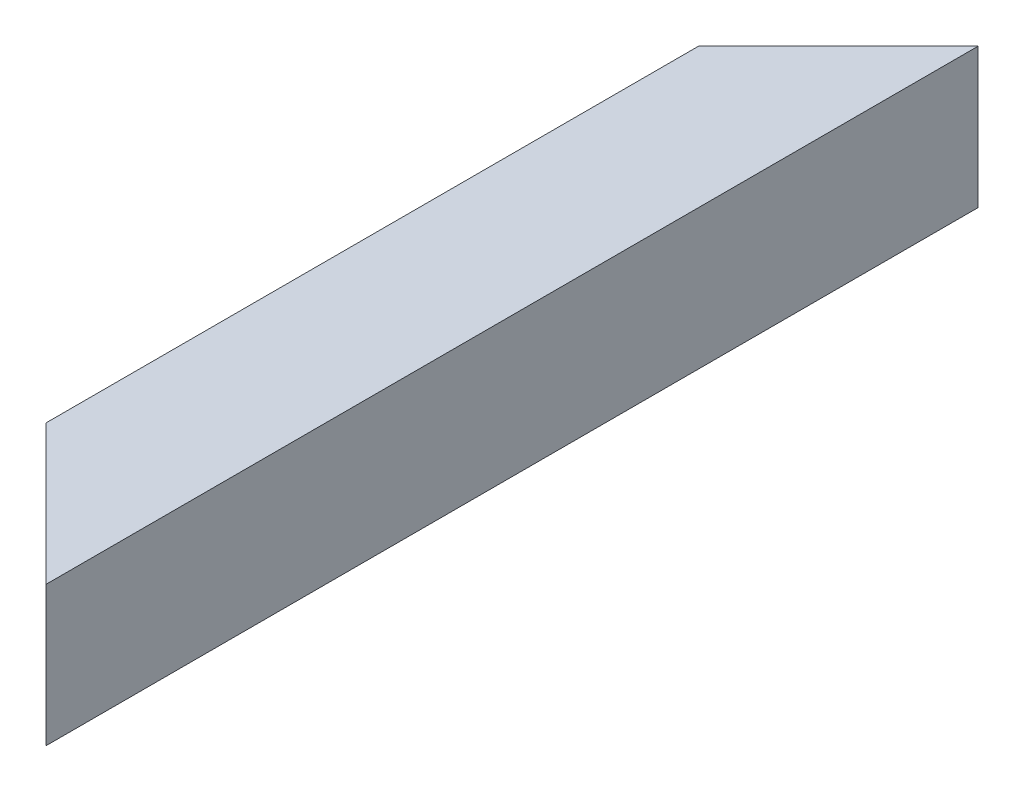
ISO-10303-21;
HEADER;
FILE_DESCRIPTION(('STEP AP214'),'2;1');
FILE_NAME('part.step','',(''),(''),'','','');
FILE_SCHEMA(('AUTOMOTIVE_DESIGN { 1 0 10303 214 1 1 1 1 }'));
ENDSEC;
DATA;
#1=APPLICATION_CONTEXT('core data for automotive mechanical design processes');
#2=APPLICATION_PROTOCOL_DEFINITION('international standard','automotive_design',2000,#1);
#3=PRODUCT_CONTEXT('',#1,'mechanical');
#4=PRODUCT('Part','Part','',(#3));
#5=PRODUCT_RELATED_PRODUCT_CATEGORY('part','',(#4));
#6=PRODUCT_DEFINITION_FORMATION('','',#4);
#7=PRODUCT_DEFINITION_CONTEXT('part definition',#1,'design');
#8=PRODUCT_DEFINITION('design','',#6,#7);
#9=PRODUCT_DEFINITION_SHAPE('','',#8);
#10=(LENGTH_UNIT() NAMED_UNIT(*) SI_UNIT(.MILLI.,.METRE.));
#11=(NAMED_UNIT(*) PLANE_ANGLE_UNIT() SI_UNIT($,.RADIAN.));
#12=(NAMED_UNIT(*) SI_UNIT($,.STERADIAN.) SOLID_ANGLE_UNIT());
#13=UNCERTAINTY_MEASURE_WITH_UNIT(LENGTH_MEASURE(1.E-05),#10,'distance_accuracy_value','');
#14=(GEOMETRIC_REPRESENTATION_CONTEXT(3) GLOBAL_UNCERTAINTY_ASSIGNED_CONTEXT((#13)) GLOBAL_UNIT_ASSIGNED_CONTEXT((#10,
#11,#12)) REPRESENTATION_CONTEXT('',''));
#15=CARTESIAN_POINT('',(0.,0.,0.));
#16=DIRECTION('',(0.,0.,1.));
#17=DIRECTION('',(1.,0.,0.));
#18=AXIS2_PLACEMENT_3D('',#15,#16,#17);
#19=CARTESIAN_POINT('',(-26.,26.,0.));
#20=DIRECTION('',(1.,0.,0.));
#21=DIRECTION('',(0.,0.,-1.));
#22=AXIS2_PLACEMENT_3D('',#19,#20,#21);
#23=PLANE('',#22);
#24=DIRECTION('',(0.,-1.,0.));
#25=VECTOR('',#24,1.);
#26=CARTESIAN_POINT('',(-26.,26.,55.9999999999994));
#27=LINE('',#26,#25);
#28=CARTESIAN_POINT('',(-26.,26.,55.9999999999994));
#29=VERTEX_POINT('',#28);
#30=CARTESIAN_POINT('',(-26.,-26.,55.9999999999994));
#31=VERTEX_POINT('',#30);
#32=EDGE_CURVE('E11',#29,#31,#27,.T.);
#33=ORIENTED_EDGE('',*,*,#32,.F.);
#34=DIRECTION('',(0.,0.,1.));
#35=VECTOR('',#34,1.);
#36=CARTESIAN_POINT('',(-26.,26.,0.));
#37=LINE('',#36,#35);
#38=CARTESIAN_POINT('',(-26.,26.,344.000000000001));
#39=VERTEX_POINT('',#38);
#40=EDGE_CURVE('E147',#29,#39,#37,.T.);
#41=ORIENTED_EDGE('',*,*,#40,.T.);
#42=DIRECTION('',(0.,1.,0.));
#43=VECTOR('',#42,1.);
#44=CARTESIAN_POINT('',(-26.,26.,344.000000000001));
#45=LINE('',#44,#43);
#46=CARTESIAN_POINT('',(-26.,-26.,344.000000000001));
#47=VERTEX_POINT('',#46);
#48=EDGE_CURVE('E45',#47,#39,#45,.T.);
#49=ORIENTED_EDGE('',*,*,#48,.F.);
#50=DIRECTION('',(0.,0.,1.));
#51=VECTOR('',#50,1.);
#52=CARTESIAN_POINT('',(-26.,-26.,0.));
#53=LINE('',#52,#51);
#54=EDGE_CURVE('E134',#31,#47,#53,.T.);
#55=ORIENTED_EDGE('',*,*,#54,.F.);
#56=EDGE_LOOP('',(#33,#41,#49,#55));
#57=FACE_BOUND('',#56,.T.);
#58=ADVANCED_FACE('F37',(#57),#23,.T.);
#59=CARTESIAN_POINT('',(-26.,-26.,0.));
#60=DIRECTION('',(0.,1.,0.));
#61=DIRECTION('',(0.,0.,1.));
#62=AXIS2_PLACEMENT_3D('',#59,#60,#61);
#63=PLANE('',#62);
#64=DIRECTION('',(0.707106781186551,0.,-0.707106781186544));
#65=VECTOR('',#64,1.);
#66=CARTESIAN_POINT('',(1.9999999999997,-26.,28.));
#67=LINE('',#66,#65);
#68=CARTESIAN_POINT('',(26.,-26.,3.99999999999995));
#69=VERTEX_POINT('',#68);
#70=EDGE_CURVE('E167',#31,#69,#67,.T.);
#71=ORIENTED_EDGE('',*,*,#70,.F.);
#72=ORIENTED_EDGE('',*,*,#54,.T.);
#73=DIRECTION('',(-0.707106781186551,0.,-0.707106781186544));
#74=VECTOR('',#73,1.);
#75=CARTESIAN_POINT('',(-198.,-26.,172.000000000002));
#76=LINE('',#75,#74);
#77=CARTESIAN_POINT('',(26.,-26.,396.));
#78=VERTEX_POINT('',#77);
#79=EDGE_CURVE('E59',#78,#47,#76,.T.);
#80=ORIENTED_EDGE('',*,*,#79,.F.);
#81=DIRECTION('',(0.,0.,1.));
#82=VECTOR('',#81,1.);
#83=CARTESIAN_POINT('',(26.,-26.,0.));
#84=LINE('',#83,#82);
#85=EDGE_CURVE('E137',#69,#78,#84,.T.);
#86=ORIENTED_EDGE('',*,*,#85,.F.);
#87=EDGE_LOOP('',(#71,#72,#80,#86));
#88=FACE_BOUND('',#87,.T.);
#89=ADVANCED_FACE('F183',(#88),#63,.T.);
#90=CARTESIAN_POINT('',(26.,26.,0.));
#91=DIRECTION('',(-1.,0.,0.));
#92=DIRECTION('',(0.,0.,1.));
#93=AXIS2_PLACEMENT_3D('',#90,#91,#92);
#94=PLANE('',#93);
#95=DIRECTION('',(0.,1.,0.));
#96=VECTOR('',#95,1.);
#97=CARTESIAN_POINT('',(26.,26.,3.99999999999995));
#98=LINE('',#97,#96);
#99=CARTESIAN_POINT('',(26.,26.,3.99999999999995));
#100=VERTEX_POINT('',#99);
#101=EDGE_CURVE('E169',#69,#100,#98,.T.);
#102=ORIENTED_EDGE('',*,*,#101,.F.);
#103=ORIENTED_EDGE('',*,*,#85,.T.);
#104=DIRECTION('',(0.,-1.,0.));
#105=VECTOR('',#104,1.);
#106=CARTESIAN_POINT('',(26.,26.,396.));
#107=LINE('',#106,#105);
#108=CARTESIAN_POINT('',(26.,26.,396.));
#109=VERTEX_POINT('',#108);
#110=EDGE_CURVE('E163',#109,#78,#107,.T.);
#111=ORIENTED_EDGE('',*,*,#110,.F.);
#112=DIRECTION('',(0.,0.,1.));
#113=VECTOR('',#112,1.);
#114=CARTESIAN_POINT('',(26.,26.,0.));
#115=LINE('',#114,#113);
#116=EDGE_CURVE('E143',#100,#109,#115,.T.);
#117=ORIENTED_EDGE('',*,*,#116,.F.);
#118=EDGE_LOOP('',(#102,#103,#111,#117));
#119=FACE_BOUND('',#118,.T.);
#120=ADVANCED_FACE('F180',(#119),#94,.T.);
#121=CARTESIAN_POINT('',(-26.,26.,0.));
#122=DIRECTION('',(0.,-1.,0.));
#123=DIRECTION('',(0.,0.,-1.));
#124=AXIS2_PLACEMENT_3D('',#121,#122,#123);
#125=PLANE('',#124);
#126=DIRECTION('',(-0.707106781186551,0.,0.707106781186544));
#127=VECTOR('',#126,1.);
#128=CARTESIAN_POINT('',(1.9999999999997,26.,28.));
#129=LINE('',#128,#127);
#130=EDGE_CURVE('E51',#100,#29,#129,.T.);
#131=ORIENTED_EDGE('',*,*,#130,.F.);
#132=ORIENTED_EDGE('',*,*,#116,.T.);
#133=DIRECTION('',(0.707106781186551,0.,0.707106781186544));
#134=VECTOR('',#133,1.);
#135=CARTESIAN_POINT('',(-198.,26.,172.000000000002));
#136=LINE('',#135,#134);
#137=EDGE_CURVE('E165',#39,#109,#136,.T.);
#138=ORIENTED_EDGE('',*,*,#137,.F.);
#139=ORIENTED_EDGE('',*,*,#40,.F.);
#140=EDGE_LOOP('',(#131,#132,#138,#139));
#141=FACE_BOUND('',#140,.T.);
#142=ADVANCED_FACE('F175',(#141),#125,.T.);
#143=CARTESIAN_POINT('',(30.,-30.,400.));
#144=DIRECTION('',(0.707106781186544,0.,-0.707106781186551));
#145=DIRECTION('',(-0.707106781186551,0.,-0.707106781186544));
#146=AXIS2_PLACEMENT_3D('',#143,#144,#145);
#147=PLANE('',#146);
#148=ORIENTED_EDGE('',*,*,#137,.T.);
#149=ORIENTED_EDGE('',*,*,#110,.T.);
#150=ORIENTED_EDGE('',*,*,#79,.T.);
#151=ORIENTED_EDGE('',*,*,#48,.T.);
#152=EDGE_LOOP('',(#148,#149,#150,#151));
#153=FACE_BOUND('',#152,.T.);
#154=DIRECTION('',(-0.707106781186551,0.,-0.707106781186543));
#155=VECTOR('',#154,1.);
#156=CARTESIAN_POINT('',(30.,30.,400.));
#157=LINE('',#156,#155);
#158=CARTESIAN_POINT('',(30.,30.,400.));
#159=VERTEX_POINT('',#158);
#160=CARTESIAN_POINT('',(-30.,30.,340.000000000001));
#161=VERTEX_POINT('',#160);
#162=EDGE_CURVE('E156',#159,#161,#157,.T.);
#163=ORIENTED_EDGE('',*,*,#162,.T.);
#164=DIRECTION('',(0.,1.,0.));
#165=VECTOR('',#164,1.);
#166=CARTESIAN_POINT('',(-30.,-30.,340.000000000001));
#167=LINE('',#166,#165);
#168=CARTESIAN_POINT('',(-30.,-30.,340.000000000001));
#169=VERTEX_POINT('',#168);
#170=EDGE_CURVE('E158',#169,#161,#167,.T.);
#171=ORIENTED_EDGE('',*,*,#170,.F.);
#172=DIRECTION('',(-0.707106781186551,0.,-0.707106781186543));
#173=VECTOR('',#172,1.);
#174=CARTESIAN_POINT('',(30.,-30.,400.));
#175=LINE('',#174,#173);
#176=CARTESIAN_POINT('',(30.,-30.,400.));
#177=VERTEX_POINT('',#176);
#178=EDGE_CURVE('E124',#177,#169,#175,.T.);
#179=ORIENTED_EDGE('',*,*,#178,.F.);
#180=DIRECTION('',(0.,1.,0.));
#181=VECTOR('',#180,1.);
#182=CARTESIAN_POINT('',(30.,30.,400.));
#183=LINE('',#182,#181);
#184=EDGE_CURVE('E146',#177,#159,#183,.T.);
#185=ORIENTED_EDGE('',*,*,#184,.T.);
#186=EDGE_LOOP('',(#163,#171,#179,#185));
#187=FACE_BOUND('',#186,.T.);
#188=ADVANCED_FACE('F182',(#153,#187),#147,.F.);
#189=CARTESIAN_POINT('',(30.,-30.,0.));
#190=DIRECTION('',(0.707106781186544,0.,0.707106781186551));
#191=DIRECTION('',(0.707106781186551,0.,-0.707106781186544));
#192=AXIS2_PLACEMENT_3D('',#189,#190,#191);
#193=PLANE('',#192);
#194=ORIENTED_EDGE('',*,*,#130,.T.);
#195=ORIENTED_EDGE('',*,*,#32,.T.);
#196=ORIENTED_EDGE('',*,*,#70,.T.);
#197=ORIENTED_EDGE('',*,*,#101,.T.);
#198=EDGE_LOOP('',(#194,#195,#196,#197));
#199=FACE_BOUND('',#198,.T.);
#200=DIRECTION('',(0.707106781186551,0.,-0.707106781186544));
#201=VECTOR('',#200,1.);
#202=CARTESIAN_POINT('',(30.,30.,0.));
#203=LINE('',#202,#201);
#204=CARTESIAN_POINT('',(-30.,30.,59.9999999999994));
#205=VERTEX_POINT('',#204);
#206=CARTESIAN_POINT('',(30.,30.,0.));
#207=VERTEX_POINT('',#206);
#208=EDGE_CURVE('E111',#205,#207,#203,.T.);
#209=ORIENTED_EDGE('',*,*,#208,.T.);
#210=DIRECTION('',(0.,1.,0.));
#211=VECTOR('',#210,1.);
#212=CARTESIAN_POINT('',(30.,30.,0.));
#213=LINE('',#212,#211);
#214=CARTESIAN_POINT('',(30.,-30.,0.));
#215=VERTEX_POINT('',#214);
#216=EDGE_CURVE('E106',#215,#207,#213,.T.);
#217=ORIENTED_EDGE('',*,*,#216,.F.);
#218=DIRECTION('',(0.707106781186551,0.,-0.707106781186544));
#219=VECTOR('',#218,1.);
#220=CARTESIAN_POINT('',(30.,-30.,0.));
#221=LINE('',#220,#219);
#222=CARTESIAN_POINT('',(-30.,-30.,59.9999999999994));
#223=VERTEX_POINT('',#222);
#224=EDGE_CURVE('E100',#223,#215,#221,.T.);
#225=ORIENTED_EDGE('',*,*,#224,.F.);
#226=DIRECTION('',(0.,1.,0.));
#227=VECTOR('',#226,1.);
#228=CARTESIAN_POINT('',(-30.,-30.,59.9999999999994));
#229=LINE('',#228,#227);
#230=EDGE_CURVE('E103',#223,#205,#229,.T.);
#231=ORIENTED_EDGE('',*,*,#230,.T.);
#232=EDGE_LOOP('',(#209,#217,#225,#231));
#233=FACE_BOUND('',#232,.T.);
#234=ADVANCED_FACE('F102',(#199,#233),#193,.F.);
#235=CARTESIAN_POINT('',(-30.,30.,0.));
#236=DIRECTION('',(-1.,0.,0.));
#237=DIRECTION('',(0.,0.,1.));
#238=AXIS2_PLACEMENT_3D('',#235,#236,#237);
#239=PLANE('',#238);
#240=ORIENTED_EDGE('',*,*,#230,.F.);
#241=DIRECTION('',(0.,0.,1.));
#242=VECTOR('',#241,1.);
#243=CARTESIAN_POINT('',(-30.,-30.,0.));
#244=LINE('',#243,#242);
#245=EDGE_CURVE('E118',#223,#169,#244,.T.);
#246=ORIENTED_EDGE('',*,*,#245,.T.);
#247=ORIENTED_EDGE('',*,*,#170,.T.);
#248=DIRECTION('',(0.,0.,1.));
#249=VECTOR('',#248,1.);
#250=CARTESIAN_POINT('',(-30.,30.,0.));
#251=LINE('',#250,#249);
#252=EDGE_CURVE('E120',#205,#161,#251,.T.);
#253=ORIENTED_EDGE('',*,*,#252,.F.);
#254=EDGE_LOOP('',(#240,#246,#247,#253));
#255=FACE_BOUND('',#254,.T.);
#256=ADVANCED_FACE('F116',(#255),#239,.T.);
#257=CARTESIAN_POINT('',(-30.,-30.,0.));
#258=DIRECTION('',(0.,-1.,0.));
#259=DIRECTION('',(0.,0.,-1.));
#260=AXIS2_PLACEMENT_3D('',#257,#258,#259);
#261=PLANE('',#260);
#262=ORIENTED_EDGE('',*,*,#224,.T.);
#263=DIRECTION('',(0.,0.,1.));
#264=VECTOR('',#263,1.);
#265=CARTESIAN_POINT('',(30.,-30.,0.));
#266=LINE('',#265,#264);
#267=EDGE_CURVE('E125',#215,#177,#266,.T.);
#268=ORIENTED_EDGE('',*,*,#267,.T.);
#269=ORIENTED_EDGE('',*,*,#178,.T.);
#270=ORIENTED_EDGE('',*,*,#245,.F.);
#271=EDGE_LOOP('',(#262,#268,#269,#270));
#272=FACE_BOUND('',#271,.T.);
#273=ADVANCED_FACE('F123',(#272),#261,.T.);
#274=CARTESIAN_POINT('',(30.,30.,0.));
#275=DIRECTION('',(1.,0.,0.));
#276=DIRECTION('',(0.,0.,-1.));
#277=AXIS2_PLACEMENT_3D('',#274,#275,#276);
#278=PLANE('',#277);
#279=DIRECTION('',(0.,0.,1.));
#280=VECTOR('',#279,1.);
#281=CARTESIAN_POINT('',(30.,30.,0.));
#282=LINE('',#281,#280);
#283=EDGE_CURVE('E127',#207,#159,#282,.T.);
#284=ORIENTED_EDGE('',*,*,#283,.T.);
#285=ORIENTED_EDGE('',*,*,#184,.F.);
#286=ORIENTED_EDGE('',*,*,#267,.F.);
#287=ORIENTED_EDGE('',*,*,#216,.T.);
#288=EDGE_LOOP('',(#284,#285,#286,#287));
#289=FACE_BOUND('',#288,.T.);
#290=ADVANCED_FACE('F154',(#289),#278,.T.);
#291=CARTESIAN_POINT('',(-30.,30.,0.));
#292=DIRECTION('',(0.,1.,0.));
#293=DIRECTION('',(0.,0.,1.));
#294=AXIS2_PLACEMENT_3D('',#291,#292,#293);
#295=PLANE('',#294);
#296=ORIENTED_EDGE('',*,*,#208,.F.);
#297=ORIENTED_EDGE('',*,*,#252,.T.);
#298=ORIENTED_EDGE('',*,*,#162,.F.);
#299=ORIENTED_EDGE('',*,*,#283,.F.);
#300=EDGE_LOOP('',(#296,#297,#298,#299));
#301=FACE_BOUND('',#300,.T.);
#302=ADVANCED_FACE('F39',(#301),#295,.T.);
#303=CLOSED_SHELL('',(#58,#89,#120,#142,#188,#234,#256,#273,#290,#302));
#304=MANIFOLD_SOLID_BREP('B2',#303);
#305=ADVANCED_BREP_SHAPE_REPRESENTATION('',(#18,#304),#14);
#306=SHAPE_DEFINITION_REPRESENTATION(#9,#305);
ENDSEC;
END-ISO-10303-21;
